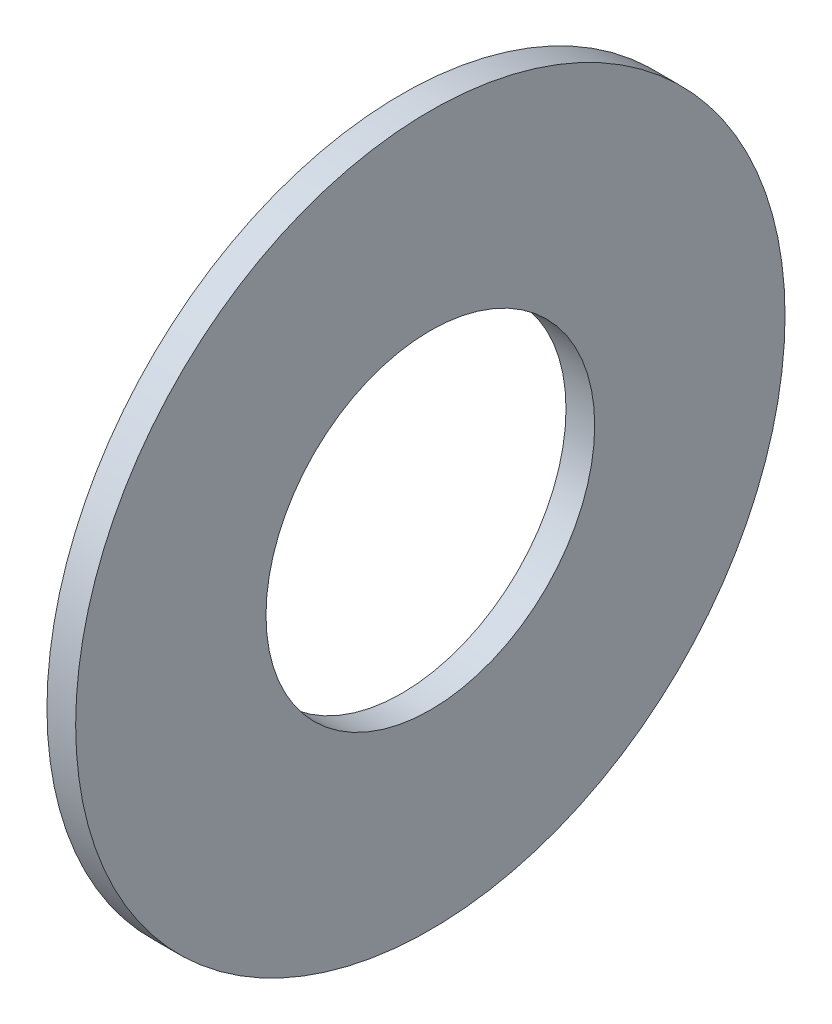
ISO-10303-21;
HEADER;
FILE_DESCRIPTION(('STEP AP214'),'2;1');
FILE_NAME('part.step','',(''),(''),'','','');
FILE_SCHEMA(('AUTOMOTIVE_DESIGN { 1 0 10303 214 1 1 1 1 }'));
ENDSEC;
DATA;
#1=APPLICATION_CONTEXT('core data for automotive mechanical design processes');
#2=APPLICATION_PROTOCOL_DEFINITION('international standard','automotive_design',2000,#1);
#3=PRODUCT_CONTEXT('',#1,'mechanical');
#4=PRODUCT('Part','Part','',(#3));
#5=PRODUCT_RELATED_PRODUCT_CATEGORY('part','',(#4));
#6=PRODUCT_DEFINITION_FORMATION('','',#4);
#7=PRODUCT_DEFINITION_CONTEXT('part definition',#1,'design');
#8=PRODUCT_DEFINITION('design','',#6,#7);
#9=PRODUCT_DEFINITION_SHAPE('','',#8);
#10=(LENGTH_UNIT() NAMED_UNIT(*) SI_UNIT(.MILLI.,.METRE.));
#11=(NAMED_UNIT(*) PLANE_ANGLE_UNIT() SI_UNIT($,.RADIAN.));
#12=(NAMED_UNIT(*) SI_UNIT($,.STERADIAN.) SOLID_ANGLE_UNIT());
#13=UNCERTAINTY_MEASURE_WITH_UNIT(LENGTH_MEASURE(1.E-05),#10,'distance_accuracy_value','');
#14=(GEOMETRIC_REPRESENTATION_CONTEXT(3) GLOBAL_UNCERTAINTY_ASSIGNED_CONTEXT((#13)) GLOBAL_UNIT_ASSIGNED_CONTEXT((#10,
#11,#12)) REPRESENTATION_CONTEXT('',''));
#15=CARTESIAN_POINT('',(0.,0.,0.));
#16=DIRECTION('',(0.,0.,1.));
#17=DIRECTION('',(1.,0.,0.));
#18=AXIS2_PLACEMENT_3D('',#15,#16,#17);
#19=CARTESIAN_POINT('',(-34.9249999999999,0.,0.));
#20=DIRECTION('',(-1.,0.,0.));
#21=DIRECTION('',(0.,0.,1.));
#22=AXIS2_PLACEMENT_3D('',#19,#20,#21);
#23=CYLINDRICAL_SURFACE('',#22,26.1874);
#24=CARTESIAN_POINT('',(0.,0.,0.));
#25=DIRECTION('',(-1.,0.,0.));
#26=DIRECTION('',(0.,0.,1.));
#27=AXIS2_PLACEMENT_3D('',#24,#25,#26);
#28=CIRCLE('',#27,26.1874);
#29=CARTESIAN_POINT('',(0.,0.,26.1874));
#30=VERTEX_POINT('',#29);
#31=EDGE_CURVE('E10',#30,#30,#28,.T.);
#32=ORIENTED_EDGE('',*,*,#31,.F.);
#33=EDGE_LOOP('',(#32));
#34=FACE_BOUND('',#33,.T.);
#35=CARTESIAN_POINT('',(-4.572,0.,0.));
#36=DIRECTION('',(-1.,0.,0.));
#37=DIRECTION('',(0.,0.,1.));
#38=AXIS2_PLACEMENT_3D('',#35,#36,#37);
#39=CIRCLE('',#38,26.1874);
#40=CARTESIAN_POINT('',(-4.572,0.,26.1874));
#41=VERTEX_POINT('',#40);
#42=EDGE_CURVE('E45',#41,#41,#39,.T.);
#43=ORIENTED_EDGE('',*,*,#42,.T.);
#44=EDGE_LOOP('',(#43));
#45=FACE_BOUND('',#44,.T.);
#46=ADVANCED_FACE('F31',(#34,#45),#23,.F.);
#47=CARTESIAN_POINT('',(0.,26.1874,0.));
#48=DIRECTION('',(-1.,0.,0.));
#49=DIRECTION('',(0.,0.,1.));
#50=AXIS2_PLACEMENT_3D('',#47,#48,#49);
#51=PLANE('',#50);
#52=CARTESIAN_POINT('',(0.,0.,0.));
#53=DIRECTION('',(-1.,0.,0.));
#54=DIRECTION('',(0.,0.,1.));
#55=AXIS2_PLACEMENT_3D('',#52,#53,#54);
#56=CIRCLE('',#55,56.515);
#57=CARTESIAN_POINT('',(0.,0.,56.515));
#58=VERTEX_POINT('',#57);
#59=EDGE_CURVE('E37',#58,#58,#56,.T.);
#60=ORIENTED_EDGE('',*,*,#59,.F.);
#61=EDGE_LOOP('',(#60));
#62=FACE_BOUND('',#61,.T.);
#63=ORIENTED_EDGE('',*,*,#31,.T.);
#64=EDGE_LOOP('',(#63));
#65=FACE_BOUND('',#64,.T.);
#66=ADVANCED_FACE('F60',(#62,#65),#51,.F.);
#67=CARTESIAN_POINT('',(-34.9249999999999,0.,0.));
#68=DIRECTION('',(-1.,0.,0.));
#69=DIRECTION('',(0.,0.,1.));
#70=AXIS2_PLACEMENT_3D('',#67,#68,#69);
#71=CYLINDRICAL_SURFACE('',#70,56.515);
#72=CARTESIAN_POINT('',(-4.572,0.,0.));
#73=DIRECTION('',(-1.,0.,0.));
#74=DIRECTION('',(0.,0.,1.));
#75=AXIS2_PLACEMENT_3D('',#72,#73,#74);
#76=CIRCLE('',#75,56.515);
#77=CARTESIAN_POINT('',(-4.572,0.,56.515));
#78=VERTEX_POINT('',#77);
#79=EDGE_CURVE('E41',#78,#78,#76,.T.);
#80=ORIENTED_EDGE('',*,*,#79,.F.);
#81=EDGE_LOOP('',(#80));
#82=FACE_BOUND('',#81,.T.);
#83=ORIENTED_EDGE('',*,*,#59,.T.);
#84=EDGE_LOOP('',(#83));
#85=FACE_BOUND('',#84,.T.);
#86=ADVANCED_FACE('F55',(#82,#85),#71,.T.);
#87=CARTESIAN_POINT('',(-4.572,56.515,0.));
#88=DIRECTION('',(1.,0.,0.));
#89=DIRECTION('',(0.,0.,-1.));
#90=AXIS2_PLACEMENT_3D('',#87,#88,#89);
#91=PLANE('',#90);
#92=ORIENTED_EDGE('',*,*,#42,.F.);
#93=EDGE_LOOP('',(#92));
#94=FACE_BOUND('',#93,.T.);
#95=ORIENTED_EDGE('',*,*,#79,.T.);
#96=EDGE_LOOP('',(#95));
#97=FACE_BOUND('',#96,.T.);
#98=ADVANCED_FACE('F52',(#94,#97),#91,.F.);
#99=CLOSED_SHELL('',(#46,#66,#86,#98));
#100=MANIFOLD_SOLID_BREP('B2',#99);
#101=ADVANCED_BREP_SHAPE_REPRESENTATION('',(#18,#100),#14);
#102=SHAPE_DEFINITION_REPRESENTATION(#9,#101);
ENDSEC;
END-ISO-10303-21;
